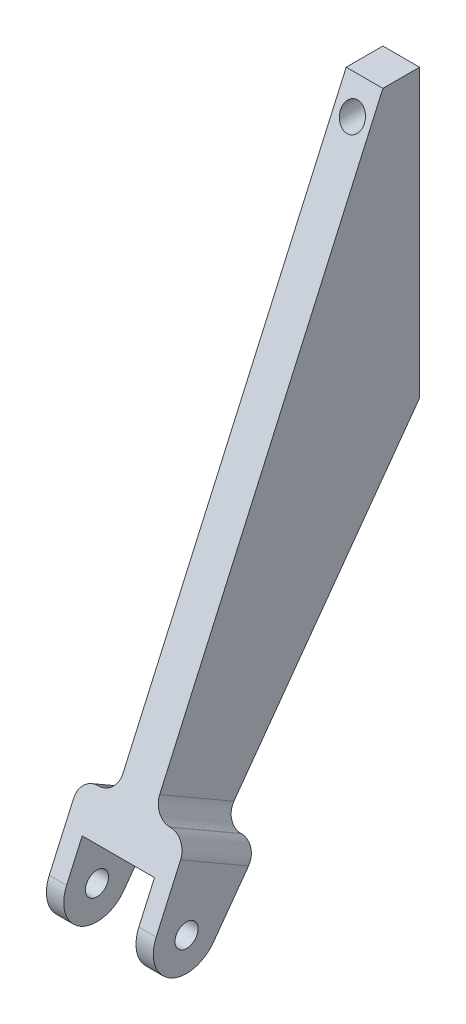
ISO-10303-21;
HEADER;
FILE_DESCRIPTION(('STEP AP214'),'2;1');
FILE_NAME('part.step','',(''),(''),'','','');
FILE_SCHEMA(('AUTOMOTIVE_DESIGN { 1 0 10303 214 1 1 1 1 }'));
ENDSEC;
DATA;
#1=APPLICATION_CONTEXT('core data for automotive mechanical design processes');
#2=APPLICATION_PROTOCOL_DEFINITION('international standard','automotive_design',2000,#1);
#3=PRODUCT_CONTEXT('',#1,'mechanical');
#4=PRODUCT('Part','Part','',(#3));
#5=PRODUCT_RELATED_PRODUCT_CATEGORY('part','',(#4));
#6=PRODUCT_DEFINITION_FORMATION('','',#4);
#7=PRODUCT_DEFINITION_CONTEXT('part definition',#1,'design');
#8=PRODUCT_DEFINITION('design','',#6,#7);
#9=PRODUCT_DEFINITION_SHAPE('','',#8);
#10=(LENGTH_UNIT() NAMED_UNIT(*) SI_UNIT(.MILLI.,.METRE.));
#11=(NAMED_UNIT(*) PLANE_ANGLE_UNIT() SI_UNIT($,.RADIAN.));
#12=(NAMED_UNIT(*) SI_UNIT($,.STERADIAN.) SOLID_ANGLE_UNIT());
#13=UNCERTAINTY_MEASURE_WITH_UNIT(LENGTH_MEASURE(1.E-05),#10,'distance_accuracy_value','');
#14=(GEOMETRIC_REPRESENTATION_CONTEXT(3) GLOBAL_UNCERTAINTY_ASSIGNED_CONTEXT((#13)) GLOBAL_UNIT_ASSIGNED_CONTEXT((#10,
#11,#12)) REPRESENTATION_CONTEXT('',''));
#15=CARTESIAN_POINT('',(0.,0.,0.));
#16=DIRECTION('',(0.,0.,1.));
#17=DIRECTION('',(1.,0.,0.));
#18=AXIS2_PLACEMENT_3D('',#15,#16,#17);
#19=CARTESIAN_POINT('',(-78.4084452466419,-210.483790761918,92.7733037843869));
#20=DIRECTION('',(1.,0.,0.));
#21=DIRECTION('',(0.,0.,-1.));
#22=AXIS2_PLACEMENT_3D('',#19,#20,#21);
#23=CYLINDRICAL_SURFACE('',#22,11.5);
#24=DIRECTION('',(1.,0.,0.));
#25=VECTOR('',#24,1.);
#26=CARTESIAN_POINT('',(-78.4084452466419,-205.796191727349,103.274561580056));
#27=LINE('',#26,#25);
#28=CARTESIAN_POINT('',(-59.558445246642,-205.796191727349,103.274561580056));
#29=VERTEX_POINT('',#28);
#30=CARTESIAN_POINT('',(-53.558445246642,-205.796191727349,103.274561580056));
#31=VERTEX_POINT('',#30);
#32=EDGE_CURVE('E257',#29,#31,#27,.T.);
#33=ORIENTED_EDGE('',*,*,#32,.F.);
#34=CARTESIAN_POINT('',(-59.558445246642,-210.483790761918,92.7733037843869));
#35=DIRECTION('',(-1.,0.,0.));
#36=DIRECTION('',(0.,0.,1.));
#37=AXIS2_PLACEMENT_3D('',#34,#35,#36);
#38=CIRCLE('',#37,11.5);
#39=CARTESIAN_POINT('',(-59.558445246642,-217.229583095587,83.4596425391511));
#40=VERTEX_POINT('',#39);
#41=EDGE_CURVE('E202',#29,#40,#38,.F.);
#42=ORIENTED_EDGE('',*,*,#41,.T.);
#43=DIRECTION('',(1.,0.,0.));
#44=VECTOR('',#43,1.);
#45=CARTESIAN_POINT('',(-78.4084452466419,-217.229583095587,83.4596425391511));
#46=LINE('',#45,#44);
#47=CARTESIAN_POINT('',(-53.558445246642,-217.229583095587,83.4596425391511));
#48=VERTEX_POINT('',#47);
#49=EDGE_CURVE('E200',#40,#48,#46,.T.);
#50=ORIENTED_EDGE('',*,*,#49,.T.);
#51=CARTESIAN_POINT('',(-53.558445246642,-210.483790761918,92.7733037843869));
#52=DIRECTION('',(1.,0.,0.));
#53=DIRECTION('',(0.,0.,-1.));
#54=AXIS2_PLACEMENT_3D('',#51,#52,#53);
#55=CIRCLE('',#54,11.5);
#56=EDGE_CURVE('E225',#31,#48,#55,.T.);
#57=ORIENTED_EDGE('',*,*,#56,.F.);
#58=EDGE_LOOP('',(#33,#42,#50,#57));
#59=FACE_BOUND('',#58,.T.);
#60=ADVANCED_FACE('F58',(#59),#23,.T.);
#61=CARTESIAN_POINT('',(-78.4084452466419,-210.483790761918,92.7733037843869));
#62=DIRECTION('',(1.,0.,0.));
#63=DIRECTION('',(0.,0.,-1.));
#64=AXIS2_PLACEMENT_3D('',#61,#62,#63);
#65=CYLINDRICAL_SURFACE('',#64,4.00000000000001);
#66=CARTESIAN_POINT('',(-53.558445246642,-210.483790761918,92.7733037843869));
#67=DIRECTION('',(1.,0.,0.));
#68=DIRECTION('',(0.,0.,-1.));
#69=AXIS2_PLACEMENT_3D('',#66,#67,#68);
#70=CIRCLE('',#69,4.00000000000001);
#71=CARTESIAN_POINT('',(-53.558445246642,-210.483790761918,88.7733037843869));
#72=VERTEX_POINT('',#71);
#73=EDGE_CURVE('E214',#72,#72,#70,.T.);
#74=ORIENTED_EDGE('',*,*,#73,.T.);
#75=EDGE_LOOP('',(#74));
#76=FACE_BOUND('',#75,.T.);
#77=CARTESIAN_POINT('',(-59.558445246642,-210.483790761918,92.7733037843869));
#78=DIRECTION('',(-1.,0.,0.));
#79=DIRECTION('',(0.,0.,1.));
#80=AXIS2_PLACEMENT_3D('',#77,#78,#79);
#81=CIRCLE('',#80,4.00000000000001);
#82=CARTESIAN_POINT('',(-59.558445246642,-210.483790761918,96.773303784387));
#83=VERTEX_POINT('',#82);
#84=EDGE_CURVE('E289',#83,#83,#81,.F.);
#85=ORIENTED_EDGE('',*,*,#84,.F.);
#86=EDGE_LOOP('',(#85));
#87=FACE_BOUND('',#86,.T.);
#88=ADVANCED_FACE('F350',(#76,#87),#65,.F.);
#89=CARTESIAN_POINT('',(-65.7084452466419,-322.212396424115,112.776));
#90=DIRECTION('',(-1.,0.,0.));
#91=DIRECTION('',(0.,0.,1.));
#92=AXIS2_PLACEMENT_3D('',#89,#90,#91);
#93=PLANE('',#92);
#94=DIRECTION('',(0.,-0.913152851797348,0.407617307353811));
#95=VECTOR('',#94,1.);
#96=CARTESIAN_POINT('',(-65.7084452466419,4.24711590624918,9.51447824157033));
#97=LINE('',#96,#95);
#98=CARTESIAN_POINT('',(-65.7084452466419,-2.88915683215951,12.7));
#99=VERTEX_POINT('',#98);
#100=CARTESIAN_POINT('',(-65.7084452466419,-175.878153334414,89.9196120477492));
#101=VERTEX_POINT('',#100);
#102=EDGE_CURVE('E258',#99,#101,#97,.T.);
#103=ORIENTED_EDGE('',*,*,#102,.T.);
#104=DIRECTION('',(0.,0.499778445707467,0.866153280433798));
#105=VECTOR('',#104,1.);
#106=CARTESIAN_POINT('',(-65.7084452466419,-190.383527582941,64.78071780933));
#107=LINE('',#106,#105);
#108=CARTESIAN_POINT('',(-65.7084452466419,-190.695002178179,64.2409091305958));
#109=VERTEX_POINT('',#108);
#110=EDGE_CURVE('E318',#101,#109,#107,.F.);
#111=ORIENTED_EDGE('',*,*,#110,.T.);
#112=DIRECTION('',(0.,-0.809883586542247,0.586590637710377));
#113=VECTOR('',#112,1.);
#114=CARTESIAN_POINT('',(-65.7084452466419,-35.0970347774457,-48.4571532091004));
#115=LINE('',#114,#113);
#116=CARTESIAN_POINT('',(-65.7084452466419,-102.,0.));
#117=VERTEX_POINT('',#116);
#118=EDGE_CURVE('E254',#117,#109,#115,.T.);
#119=ORIENTED_EDGE('',*,*,#118,.F.);
#120=DIRECTION('',(0.,1.,0.));
#121=VECTOR('',#120,1.);
#122=CARTESIAN_POINT('',(-65.7084452466419,-322.212396424115,0.));
#123=LINE('',#122,#121);
#124=CARTESIAN_POINT('',(-65.7084452466419,-2.88915683215951,0.));
#125=VERTEX_POINT('',#124);
#126=EDGE_CURVE('E265',#117,#125,#123,.T.);
#127=ORIENTED_EDGE('',*,*,#126,.T.);
#128=DIRECTION('',(0.,0.,-1.));
#129=VECTOR('',#128,1.);
#130=CARTESIAN_POINT('',(-65.7084452466419,-2.88915683215951,112.776));
#131=LINE('',#130,#129);
#132=EDGE_CURVE('E284',#99,#125,#131,.T.);
#133=ORIENTED_EDGE('',*,*,#132,.F.);
#134=EDGE_LOOP('',(#103,#111,#119,#127,#133));
#135=FACE_BOUND('',#134,.T.);
#136=ADVANCED_FACE('F333',(#135),#93,.F.);
#137=CARTESIAN_POINT('',(-78.4084452466419,-322.212396424115,112.776));
#138=DIRECTION('',(1.,0.,0.));
#139=DIRECTION('',(0.,0.,-1.));
#140=AXIS2_PLACEMENT_3D('',#137,#138,#139);
#141=PLANE('',#140);
#142=DIRECTION('',(0.,-0.809883586542247,0.586590637710377));
#143=VECTOR('',#142,1.);
#144=CARTESIAN_POINT('',(-78.4084452466419,-35.0970347774457,-48.4571532091004));
#145=LINE('',#144,#143);
#146=CARTESIAN_POINT('',(-78.4084452466419,-102.,0.));
#147=VERTEX_POINT('',#146);
#148=CARTESIAN_POINT('',(-78.4084452466419,-190.695002178179,64.2409091305958));
#149=VERTEX_POINT('',#148);
#150=EDGE_CURVE('E253',#147,#149,#145,.T.);
#151=ORIENTED_EDGE('',*,*,#150,.T.);
#152=DIRECTION('',(0.,-0.499778445707467,-0.866153280433798));
#153=VECTOR('',#152,1.);
#154=CARTESIAN_POINT('',(-78.4084452466419,-176.189627929652,89.3798033690149));
#155=LINE('',#154,#153);
#156=CARTESIAN_POINT('',(-78.4084452466419,-175.878153334414,89.9196120477492));
#157=VERTEX_POINT('',#156);
#158=EDGE_CURVE('E308',#149,#157,#155,.F.);
#159=ORIENTED_EDGE('',*,*,#158,.T.);
#160=DIRECTION('',(0.,-0.913152851797348,0.407617307353811));
#161=VECTOR('',#160,1.);
#162=CARTESIAN_POINT('',(-78.4084452466419,4.24711590624918,9.51447824157033));
#163=LINE('',#162,#161);
#164=CARTESIAN_POINT('',(-78.4084452466419,-2.88915683215951,12.7));
#165=VERTEX_POINT('',#164);
#166=EDGE_CURVE('E250',#165,#157,#163,.T.);
#167=ORIENTED_EDGE('',*,*,#166,.F.);
#168=DIRECTION('',(0.,0.,-1.));
#169=VECTOR('',#168,1.);
#170=CARTESIAN_POINT('',(-78.4084452466419,-2.88915683215951,112.776));
#171=LINE('',#170,#169);
#172=CARTESIAN_POINT('',(-78.4084452466419,-2.88915683215951,0.));
#173=VERTEX_POINT('',#172);
#174=EDGE_CURVE('E282',#165,#173,#171,.T.);
#175=ORIENTED_EDGE('',*,*,#174,.T.);
#176=DIRECTION('',(0.,-1.,0.));
#177=VECTOR('',#176,1.);
#178=CARTESIAN_POINT('',(-78.4084452466419,-322.212396424115,0.));
#179=LINE('',#178,#177);
#180=EDGE_CURVE('E279',#173,#147,#179,.T.);
#181=ORIENTED_EDGE('',*,*,#180,.T.);
#182=EDGE_LOOP('',(#151,#159,#167,#175,#181));
#183=FACE_BOUND('',#182,.T.);
#184=ADVANCED_FACE('F398',(#183),#141,.F.);
#185=CARTESIAN_POINT('',(-78.4084452466419,-2.88915683215951,112.776));
#186=DIRECTION('',(0.,-1.,0.));
#187=DIRECTION('',(0.,0.,-1.));
#188=AXIS2_PLACEMENT_3D('',#185,#186,#187);
#189=PLANE('',#188);
#190=DIRECTION('',(1.,0.,0.));
#191=VECTOR('',#190,1.);
#192=CARTESIAN_POINT('',(-78.4084452466419,-2.88915683215951,12.7));
#193=LINE('',#192,#191);
#194=EDGE_CURVE('E268',#165,#99,#193,.T.);
#195=ORIENTED_EDGE('',*,*,#194,.T.);
#196=ORIENTED_EDGE('',*,*,#132,.T.);
#197=DIRECTION('',(-1.,0.,0.));
#198=VECTOR('',#197,1.);
#199=CARTESIAN_POINT('',(-78.4084452466419,-2.88915683215951,0.));
#200=LINE('',#199,#198);
#201=EDGE_CURVE('E276',#125,#173,#200,.T.);
#202=ORIENTED_EDGE('',*,*,#201,.T.);
#203=ORIENTED_EDGE('',*,*,#174,.F.);
#204=EDGE_LOOP('',(#195,#196,#202,#203));
#205=FACE_BOUND('',#204,.T.);
#206=ADVANCED_FACE('F369',(#205),#189,.F.);
#207=CARTESIAN_POINT('',(0.,0.,0.));
#208=DIRECTION('',(0.,0.,-1.));
#209=DIRECTION('',(-1.,0.,0.));
#210=AXIS2_PLACEMENT_3D('',#207,#208,#209);
#211=PLANE('',#210);
#212=CARTESIAN_POINT('',(-72.,-12.4141568321594,0.));
#213=DIRECTION('',(0.,0.,-1.));
#214=DIRECTION('',(-1.,0.,0.));
#215=AXIS2_PLACEMENT_3D('',#212,#213,#214);
#216=CIRCLE('',#215,4.12750000000001);
#217=CARTESIAN_POINT('',(-76.1275,-12.4141568321594,0.));
#218=VERTEX_POINT('',#217);
#219=EDGE_CURVE('E241',#218,#218,#216,.T.);
#220=ORIENTED_EDGE('',*,*,#219,.F.);
#221=EDGE_LOOP('',(#220));
#222=FACE_BOUND('',#221,.T.);
#223=CARTESIAN_POINT('',(-72.,-91.7891568321594,0.));
#224=DIRECTION('',(0.,0.,-1.));
#225=DIRECTION('',(-1.,0.,0.));
#226=AXIS2_PLACEMENT_3D('',#223,#224,#225);
#227=CIRCLE('',#226,4.12750000000001);
#228=CARTESIAN_POINT('',(-76.1275,-91.7891568321594,0.));
#229=VERTEX_POINT('',#228);
#230=EDGE_CURVE('E240',#229,#229,#227,.T.);
#231=ORIENTED_EDGE('',*,*,#230,.F.);
#232=EDGE_LOOP('',(#231));
#233=FACE_BOUND('',#232,.T.);
#234=DIRECTION('',(1.,0.,0.));
#235=VECTOR('',#234,1.);
#236=CARTESIAN_POINT('',(-78.4084452466419,-102.,0.));
#237=LINE('',#236,#235);
#238=EDGE_CURVE('E266',#147,#117,#237,.T.);
#239=ORIENTED_EDGE('',*,*,#238,.F.);
#240=ORIENTED_EDGE('',*,*,#180,.F.);
#241=ORIENTED_EDGE('',*,*,#201,.F.);
#242=ORIENTED_EDGE('',*,*,#126,.F.);
#243=EDGE_LOOP('',(#239,#240,#241,#242));
#244=FACE_BOUND('',#243,.T.);
#245=ADVANCED_FACE('F362',(#222,#233,#244),#211,.T.);
#246=CARTESIAN_POINT('',(-84.558445246642,-210.483790761918,92.7733037843869));
#247=DIRECTION('',(-1.,0.,0.));
#248=DIRECTION('',(0.,0.,1.));
#249=AXIS2_PLACEMENT_3D('',#246,#247,#248);
#250=CIRCLE('',#249,11.5);
#251=CARTESIAN_POINT('',(-84.558445246642,-205.796191727349,103.274561580056));
#252=VERTEX_POINT('',#251);
#253=CARTESIAN_POINT('',(-84.558445246642,-217.229583095587,83.4596425391511));
#254=VERTEX_POINT('',#253);
#255=EDGE_CURVE('E211',#252,#254,#250,.F.);
#256=ORIENTED_EDGE('',*,*,#255,.F.);
#257=CARTESIAN_POINT('',(-90.558445246642,-205.796191727349,103.274561580056));
#258=VERTEX_POINT('',#257);
#259=EDGE_CURVE('E271',#258,#252,#27,.T.);
#260=ORIENTED_EDGE('',*,*,#259,.F.);
#261=CARTESIAN_POINT('',(-90.558445246642,-210.483790761918,92.7733037843869));
#262=DIRECTION('',(1.,0.,0.));
#263=DIRECTION('',(0.,0.,-1.));
#264=AXIS2_PLACEMENT_3D('',#261,#262,#263);
#265=CIRCLE('',#264,11.5);
#266=CARTESIAN_POINT('',(-90.558445246642,-217.229583095587,83.4596425391511));
#267=VERTEX_POINT('',#266);
#268=EDGE_CURVE('E223',#258,#267,#265,.T.);
#269=ORIENTED_EDGE('',*,*,#268,.T.);
#270=EDGE_CURVE('E262',#267,#254,#46,.T.);
#271=ORIENTED_EDGE('',*,*,#270,.T.);
#272=EDGE_LOOP('',(#256,#260,#269,#271));
#273=FACE_BOUND('',#272,.T.);
#274=ADVANCED_FACE('F352',(#273),#23,.T.);
#275=CARTESIAN_POINT('',(-78.4084452466419,-35.0970347774457,-48.4571532091004));
#276=DIRECTION('',(0.,0.586590637710377,0.809883586542247));
#277=DIRECTION('',(0.,-0.809883586542247,0.586590637710377));
#278=AXIS2_PLACEMENT_3D('',#275,#276,#277);
#279=PLANE('',#278);
#280=DIRECTION('',(0.,0.809883586542247,-0.586590637710377));
#281=VECTOR('',#280,1.);
#282=CARTESIAN_POINT('',(-90.558445246642,-217.229583095587,83.4596425391511));
#283=LINE('',#282,#281);
#284=CARTESIAN_POINT('',(-90.558445246642,-200.465892352909,71.3178678365538));
#285=VERTEX_POINT('',#284);
#286=EDGE_CURVE('E217',#267,#285,#283,.T.);
#287=ORIENTED_EDGE('',*,*,#286,.T.);
#288=CARTESIAN_POINT('',(-84.558445246642,-200.465892352909,71.3178678365538));
#289=DIRECTION('',(0.,0.586590637710377,0.809883586542247));
#290=DIRECTION('',(0.,-0.809883586542247,0.586590637710377));
#291=AXIS2_PLACEMENT_3D('',#288,#289,#290);
#292=ELLIPSE('',#291,6.03228064939915,6.);
#293=CARTESIAN_POINT('',(-84.558445246642,-195.580447265544,67.7793884835748));
#294=VERTEX_POINT('',#293);
#295=EDGE_CURVE('E306',#285,#294,#292,.F.);
#296=ORIENTED_EDGE('',*,*,#295,.T.);
#297=DIRECTION('',(-1.,0.,0.));
#298=VECTOR('',#297,1.);
#299=CARTESIAN_POINT('',(-53.558445246642,-195.580447265544,67.7793884835748));
#300=LINE('',#299,#298);
#301=CARTESIAN_POINT('',(-84.408445246642,-195.580447265544,67.7793884835748));
#302=VERTEX_POINT('',#301);
#303=EDGE_CURVE('E237',#302,#294,#300,.T.);
#304=ORIENTED_EDGE('',*,*,#303,.F.);
#305=CARTESIAN_POINT('',(-84.408445246642,-190.695002178179,64.2409091305958));
#306=DIRECTION('',(0.,0.586590637710377,0.809883586542247));
#307=DIRECTION('',(0.,-0.809883586542247,0.586590637710377));
#308=AXIS2_PLACEMENT_3D('',#305,#306,#307);
#309=ELLIPSE('',#308,6.03228064939915,6.);
#310=EDGE_CURVE('E320',#302,#149,#309,.T.);
#311=ORIENTED_EDGE('',*,*,#310,.T.);
#312=ORIENTED_EDGE('',*,*,#150,.F.);
#313=ORIENTED_EDGE('',*,*,#238,.T.);
#314=ORIENTED_EDGE('',*,*,#118,.T.);
#315=CARTESIAN_POINT('',(-59.708445246642,-190.695002178179,64.2409091305958));
#316=DIRECTION('',(0.,0.586590637710377,0.809883586542247));
#317=DIRECTION('',(0.,0.809883586542247,-0.586590637710377));
#318=AXIS2_PLACEMENT_3D('',#315,#316,#317);
#319=ELLIPSE('',#318,6.03228064939915,6.);
#320=CARTESIAN_POINT('',(-59.708445246642,-195.580447265544,67.7793884835748));
#321=VERTEX_POINT('',#320);
#322=EDGE_CURVE('E12',#109,#321,#319,.T.);
#323=ORIENTED_EDGE('',*,*,#322,.T.);
#324=CARTESIAN_POINT('',(-59.558445246642,-195.580447265544,67.7793884835748));
#325=VERTEX_POINT('',#324);
#326=EDGE_CURVE('E238',#325,#321,#300,.T.);
#327=ORIENTED_EDGE('',*,*,#326,.F.);
#328=CARTESIAN_POINT('',(-59.558445246642,-200.465892352909,71.3178678365538));
#329=DIRECTION('',(0.,0.586590637710377,0.809883586542247));
#330=DIRECTION('',(0.,0.809883586542247,-0.586590637710377));
#331=AXIS2_PLACEMENT_3D('',#328,#329,#330);
#332=ELLIPSE('',#331,6.03228064939915,6.);
#333=CARTESIAN_POINT('',(-53.558445246642,-200.465892352909,71.3178678365538));
#334=VERTEX_POINT('',#333);
#335=EDGE_CURVE('E73',#325,#334,#332,.F.);
#336=ORIENTED_EDGE('',*,*,#335,.T.);
#337=DIRECTION('',(0.,0.809883586542247,-0.586590637710377));
#338=VECTOR('',#337,1.);
#339=CARTESIAN_POINT('',(-53.558445246642,-217.229583095587,83.4596425391511));
#340=LINE('',#339,#338);
#341=EDGE_CURVE('E220',#48,#334,#340,.T.);
#342=ORIENTED_EDGE('',*,*,#341,.F.);
#343=ORIENTED_EDGE('',*,*,#49,.F.);
#344=DIRECTION('',(0.,-0.809883586542247,0.586590637710377));
#345=VECTOR('',#344,1.);
#346=CARTESIAN_POINT('',(-59.558445246642,-35.0970347774457,-48.4571532091004));
#347=LINE('',#346,#345);
#348=CARTESIAN_POINT('',(-59.558445246642,-206.491274627326,75.6819923718946));
#349=VERTEX_POINT('',#348);
#350=EDGE_CURVE('E192',#349,#40,#347,.T.);
#351=ORIENTED_EDGE('',*,*,#350,.F.);
#352=DIRECTION('',(-1.,0.,0.));
#353=VECTOR('',#352,1.);
#354=CARTESIAN_POINT('',(-78.4084452466419,-206.491274627326,75.6819923718947));
#355=LINE('',#354,#353);
#356=CARTESIAN_POINT('',(-84.558445246642,-206.491274627326,75.6819923718946));
#357=VERTEX_POINT('',#356);
#358=EDGE_CURVE('E178',#349,#357,#355,.T.);
#359=ORIENTED_EDGE('',*,*,#358,.T.);
#360=DIRECTION('',(0.,-0.809883586542247,0.586590637710377));
#361=VECTOR('',#360,1.);
#362=CARTESIAN_POINT('',(-84.558445246642,-35.0970347774457,-48.4571532091004));
#363=LINE('',#362,#361);
#364=EDGE_CURVE('E188',#357,#254,#363,.T.);
#365=ORIENTED_EDGE('',*,*,#364,.T.);
#366=ORIENTED_EDGE('',*,*,#270,.F.);
#367=EDGE_LOOP('',(#287,#296,#304,#311,#312,#313,#314,#323,#327,#336,#342,#343,#351,#359,#365,#366));
#368=FACE_BOUND('',#367,.T.);
#369=ADVANCED_FACE('F199',(#368),#279,.F.);
#370=CARTESIAN_POINT('',(-78.4084452466419,4.24711590624918,9.51447824157033));
#371=DIRECTION('',(0.,0.407617307353811,0.913152851797348));
#372=DIRECTION('',(0.,-0.913152851797348,0.407617307353811));
#373=AXIS2_PLACEMENT_3D('',#370,#371,#372);
#374=PLANE('',#373);
#375=DIRECTION('',(-1.,0.,0.));
#376=VECTOR('',#375,1.);
#377=CARTESIAN_POINT('',(-53.558445246642,-181.386547612255,92.3784740432597));
#378=LINE('',#377,#376);
#379=CARTESIAN_POINT('',(-84.408445246642,-181.386547612255,92.3784740432597));
#380=VERTEX_POINT('',#379);
#381=CARTESIAN_POINT('',(-84.558445246642,-181.386547612255,92.3784740432597));
#382=VERTEX_POINT('',#381);
#383=EDGE_CURVE('E228',#380,#382,#378,.T.);
#384=ORIENTED_EDGE('',*,*,#383,.T.);
#385=CARTESIAN_POINT('',(-84.558445246642,-186.894941890096,94.8373360387703));
#386=DIRECTION('',(0.,0.407617307353811,0.913152851797348));
#387=DIRECTION('',(0.,0.913152851797348,-0.407617307353811));
#388=AXIS2_PLACEMENT_3D('',#385,#386,#387);
#389=ELLIPSE('',#388,6.03228064939915,6.);
#390=CARTESIAN_POINT('',(-90.558445246642,-186.894941890096,94.8373360387703));
#391=VERTEX_POINT('',#390);
#392=EDGE_CURVE('E301',#382,#391,#389,.T.);
#393=ORIENTED_EDGE('',*,*,#392,.T.);
#394=DIRECTION('',(0.,-0.913152851797348,0.407617307353811));
#395=VECTOR('',#394,1.);
#396=CARTESIAN_POINT('',(-90.558445246642,-205.796191727349,103.274561580056));
#397=LINE('',#396,#395);
#398=EDGE_CURVE('E230',#391,#258,#397,.T.);
#399=ORIENTED_EDGE('',*,*,#398,.T.);
#400=ORIENTED_EDGE('',*,*,#259,.T.);
#401=DIRECTION('',(0.,-0.913152851797348,0.407617307353811));
#402=VECTOR('',#401,1.);
#403=CARTESIAN_POINT('',(-84.558445246642,4.24711590624918,9.51447824157033));
#404=LINE('',#403,#402);
#405=CARTESIAN_POINT('',(-84.558445246642,-193.6886281661,97.8699324999));
#406=VERTEX_POINT('',#405);
#407=EDGE_CURVE('E205',#406,#252,#404,.T.);
#408=ORIENTED_EDGE('',*,*,#407,.F.);
#409=DIRECTION('',(-1.,0.,0.));
#410=VECTOR('',#409,1.);
#411=CARTESIAN_POINT('',(-78.4084452466419,-193.6886281661,97.8699324999));
#412=LINE('',#411,#410);
#413=CARTESIAN_POINT('',(-59.558445246642,-193.6886281661,97.8699324999));
#414=VERTEX_POINT('',#413);
#415=EDGE_CURVE('E286',#414,#406,#412,.T.);
#416=ORIENTED_EDGE('',*,*,#415,.F.);
#417=DIRECTION('',(0.,-0.913152851797348,0.407617307353811));
#418=VECTOR('',#417,1.);
#419=CARTESIAN_POINT('',(-59.558445246642,4.24711590624918,9.51447824157033));
#420=LINE('',#419,#418);
#421=EDGE_CURVE('E195',#414,#29,#420,.T.);
#422=ORIENTED_EDGE('',*,*,#421,.T.);
#423=ORIENTED_EDGE('',*,*,#32,.T.);
#424=DIRECTION('',(0.,-0.913152851797348,0.407617307353811));
#425=VECTOR('',#424,1.);
#426=CARTESIAN_POINT('',(-53.558445246642,-205.796191727349,103.274561580056));
#427=LINE('',#426,#425);
#428=CARTESIAN_POINT('',(-53.558445246642,-186.894941890096,94.8373360387703));
#429=VERTEX_POINT('',#428);
#430=EDGE_CURVE('E222',#429,#31,#427,.T.);
#431=ORIENTED_EDGE('',*,*,#430,.F.);
#432=CARTESIAN_POINT('',(-59.558445246642,-186.894941890096,94.8373360387703));
#433=DIRECTION('',(0.,0.407617307353811,0.913152851797348));
#434=DIRECTION('',(0.,-0.913152851797348,0.407617307353811));
#435=AXIS2_PLACEMENT_3D('',#432,#433,#434);
#436=ELLIPSE('',#435,6.03228064939915,6.);
#437=CARTESIAN_POINT('',(-59.558445246642,-181.386547612255,92.3784740432597));
#438=VERTEX_POINT('',#437);
#439=EDGE_CURVE('E299',#429,#438,#436,.T.);
#440=ORIENTED_EDGE('',*,*,#439,.T.);
#441=CARTESIAN_POINT('',(-59.708445246642,-181.386547612255,92.3784740432597));
#442=VERTEX_POINT('',#441);
#443=EDGE_CURVE('E234',#438,#442,#378,.T.);
#444=ORIENTED_EDGE('',*,*,#443,.T.);
#445=CARTESIAN_POINT('',(-59.708445246642,-175.878153334414,89.9196120477491));
#446=DIRECTION('',(0.,0.407617307353811,0.913152851797348));
#447=DIRECTION('',(0.,-0.913152851797348,0.407617307353811));
#448=AXIS2_PLACEMENT_3D('',#445,#446,#447);
#449=ELLIPSE('',#448,6.03228064939915,6.);
#450=EDGE_CURVE('E66',#442,#101,#449,.F.);
#451=ORIENTED_EDGE('',*,*,#450,.T.);
#452=ORIENTED_EDGE('',*,*,#102,.F.);
#453=ORIENTED_EDGE('',*,*,#194,.F.);
#454=ORIENTED_EDGE('',*,*,#166,.T.);
#455=CARTESIAN_POINT('',(-84.408445246642,-175.878153334414,89.9196120477491));
#456=DIRECTION('',(0.,0.407617307353811,0.913152851797348));
#457=DIRECTION('',(0.,0.913152851797348,-0.407617307353811));
#458=AXIS2_PLACEMENT_3D('',#455,#456,#457);
#459=ELLIPSE('',#458,6.03228064939915,6.);
#460=EDGE_CURVE('E322',#157,#380,#459,.F.);
#461=ORIENTED_EDGE('',*,*,#460,.T.);
#462=EDGE_LOOP('',(#384,#393,#399,#400,#408,#416,#422,#423,#431,#440,#444,#451,#452,#453,#454,#461));
#463=FACE_BOUND('',#462,.T.);
#464=CARTESIAN_POINT('',(-72.,-12.4141568321594,16.9518126564496));
#465=DIRECTION('',(0.,0.407617307353811,0.913152851797348));
#466=DIRECTION('',(0.,0.913152851797348,-0.407617307353811));
#467=AXIS2_PLACEMENT_3D('',#464,#465,#466);
#468=ELLIPSE('',#467,4.52005378056467,4.12750000000001);
#469=CARTESIAN_POINT('',(-72.,-8.28665683215941,15.1093605053214));
#470=VERTEX_POINT('',#469);
#471=EDGE_CURVE('E244',#470,#470,#468,.T.);
#472=ORIENTED_EDGE('',*,*,#471,.F.);
#473=EDGE_LOOP('',(#472));
#474=FACE_BOUND('',#473,.T.);
#475=ADVANCED_FACE('F325',(#463,#474),#374,.T.);
#476=CARTESIAN_POINT('',(-72.,-12.4141568321594,25.4));
#477=DIRECTION('',(0.,0.,-1.));
#478=DIRECTION('',(-1.,0.,0.));
#479=AXIS2_PLACEMENT_3D('',#476,#477,#478);
#480=CYLINDRICAL_SURFACE('',#479,4.12750000000001);
#481=ORIENTED_EDGE('',*,*,#471,.T.);
#482=EDGE_LOOP('',(#481));
#483=FACE_BOUND('',#482,.T.);
#484=ORIENTED_EDGE('',*,*,#219,.T.);
#485=EDGE_LOOP('',(#484));
#486=FACE_BOUND('',#485,.T.);
#487=ADVANCED_FACE('F488',(#483,#486),#480,.F.);
#488=CARTESIAN_POINT('',(-72.,-91.7891568321594,25.4));
#489=DIRECTION('',(0.,0.,-1.));
#490=DIRECTION('',(-1.,0.,0.));
#491=AXIS2_PLACEMENT_3D('',#488,#489,#490);
#492=CYLINDRICAL_SURFACE('',#491,4.12750000000001);
#493=CARTESIAN_POINT('',(-72.,-91.7891568321594,25.4));
#494=DIRECTION('',(0.,0.,-1.));
#495=DIRECTION('',(-1.,0.,0.));
#496=AXIS2_PLACEMENT_3D('',#493,#494,#495);
#497=CIRCLE('',#496,4.12750000000001);
#498=CARTESIAN_POINT('',(-76.1275,-91.7891568321594,25.4));
#499=VERTEX_POINT('',#498);
#500=EDGE_CURVE('E245',#499,#499,#497,.T.);
#501=ORIENTED_EDGE('',*,*,#500,.F.);
#502=EDGE_LOOP('',(#501));
#503=FACE_BOUND('',#502,.T.);
#504=ORIENTED_EDGE('',*,*,#230,.T.);
#505=EDGE_LOOP('',(#504));
#506=FACE_BOUND('',#505,.T.);
#507=ADVANCED_FACE('F563',(#503,#506),#492,.F.);
#508=CARTESIAN_POINT('',(-72.,-91.7891568321594,25.4));
#509=DIRECTION('',(0.,0.,-1.));
#510=DIRECTION('',(-1.,0.,0.));
#511=AXIS2_PLACEMENT_3D('',#508,#509,#510);
#512=PLANE('',#511);
#513=ORIENTED_EDGE('',*,*,#500,.T.);
#514=EDGE_LOOP('',(#513));
#515=FACE_BOUND('',#514,.T.);
#516=ADVANCED_FACE('F479',(#515),#512,.T.);
#517=CARTESIAN_POINT('',(-53.558445246642,-195.580447265544,67.7793884835748));
#518=DIRECTION('',(0.,-0.866153280433798,0.499778445707467));
#519=DIRECTION('',(0.,-0.499778445707467,-0.866153280433798));
#520=AXIS2_PLACEMENT_3D('',#517,#518,#519);
#521=PLANE('',#520);
#522=ORIENTED_EDGE('',*,*,#303,.T.);
#523=DIRECTION('',(0.,0.499778445707467,0.866153280433798));
#524=VECTOR('',#523,1.);
#525=CARTESIAN_POINT('',(-84.558445246642,-195.580447265544,67.7793884835748));
#526=LINE('',#525,#524);
#527=EDGE_CURVE('E296',#294,#382,#526,.T.);
#528=ORIENTED_EDGE('',*,*,#527,.T.);
#529=ORIENTED_EDGE('',*,*,#383,.F.);
#530=DIRECTION('',(0.,-0.499778445707467,-0.866153280433798));
#531=VECTOR('',#530,1.);
#532=CARTESIAN_POINT('',(-84.408445246642,-195.580447265544,67.7793884835748));
#533=LINE('',#532,#531);
#534=EDGE_CURVE('E293',#380,#302,#533,.T.);
#535=ORIENTED_EDGE('',*,*,#534,.T.);
#536=EDGE_LOOP('',(#522,#528,#529,#535));
#537=FACE_BOUND('',#536,.T.);
#538=ADVANCED_FACE('F389',(#537),#521,.F.);
#539=CARTESIAN_POINT('',(-90.558445246642,-210.483790761918,92.7733037843869));
#540=DIRECTION('',(1.,0.,0.));
#541=DIRECTION('',(0.,0.,-1.));
#542=AXIS2_PLACEMENT_3D('',#539,#540,#541);
#543=PLANE('',#542);
#544=ORIENTED_EDGE('',*,*,#398,.F.);
#545=DIRECTION('',(0.,0.499778445707467,0.866153280433798));
#546=VECTOR('',#545,1.);
#547=CARTESIAN_POINT('',(-90.558445246642,-193.680417121502,83.0776019376621));
#548=LINE('',#547,#546);
#549=EDGE_CURVE('E303',#391,#285,#548,.F.);
#550=ORIENTED_EDGE('',*,*,#549,.T.);
#551=ORIENTED_EDGE('',*,*,#286,.F.);
#552=ORIENTED_EDGE('',*,*,#268,.F.);
#553=EDGE_LOOP('',(#544,#550,#551,#552));
#554=FACE_BOUND('',#553,.T.);
#555=CARTESIAN_POINT('',(-90.558445246642,-210.483790761918,92.7733037843869));
#556=DIRECTION('',(1.,0.,0.));
#557=DIRECTION('',(0.,0.,-1.));
#558=AXIS2_PLACEMENT_3D('',#555,#556,#557);
#559=CIRCLE('',#558,4.00000000000001);
#560=CARTESIAN_POINT('',(-90.558445246642,-210.483790761918,88.7733037843869));
#561=VERTEX_POINT('',#560);
#562=EDGE_CURVE('E187',#561,#561,#559,.T.);
#563=ORIENTED_EDGE('',*,*,#562,.T.);
#564=EDGE_LOOP('',(#563));
#565=FACE_BOUND('',#564,.T.);
#566=ADVANCED_FACE('F379',(#554,#565),#543,.F.);
#567=CARTESIAN_POINT('',(-84.558445246642,-210.483790761918,92.7733037843869));
#568=DIRECTION('',(-1.,0.,0.));
#569=DIRECTION('',(0.,0.,1.));
#570=AXIS2_PLACEMENT_3D('',#567,#568,#569);
#571=CIRCLE('',#570,4.00000000000001);
#572=CARTESIAN_POINT('',(-84.558445246642,-210.483790761918,96.773303784387));
#573=VERTEX_POINT('',#572);
#574=EDGE_CURVE('E201',#573,#573,#571,.F.);
#575=ORIENTED_EDGE('',*,*,#574,.T.);
#576=EDGE_LOOP('',(#575));
#577=FACE_BOUND('',#576,.T.);
#578=ORIENTED_EDGE('',*,*,#562,.F.);
#579=EDGE_LOOP('',(#578));
#580=FACE_BOUND('',#579,.T.);
#581=ADVANCED_FACE('F358',(#577,#580),#65,.F.);
#582=ORIENTED_EDGE('',*,*,#443,.F.);
#583=DIRECTION('',(0.,0.499778445707467,0.866153280433798));
#584=VECTOR('',#583,1.);
#585=CARTESIAN_POINT('',(-59.558445246642,-195.580447265544,67.7793884835748));
#586=LINE('',#585,#584);
#587=EDGE_CURVE('E316',#438,#325,#586,.F.);
#588=ORIENTED_EDGE('',*,*,#587,.T.);
#589=ORIENTED_EDGE('',*,*,#326,.T.);
#590=DIRECTION('',(0.,0.499778445707467,0.866153280433798));
#591=VECTOR('',#590,1.);
#592=CARTESIAN_POINT('',(-59.708445246642,-181.386547612255,92.3784740432597));
#593=LINE('',#592,#591);
#594=EDGE_CURVE('E313',#321,#442,#593,.T.);
#595=ORIENTED_EDGE('',*,*,#594,.T.);
#596=EDGE_LOOP('',(#582,#588,#589,#595));
#597=FACE_BOUND('',#596,.T.);
#598=ADVANCED_FACE('F336',(#597),#521,.F.);
#599=CARTESIAN_POINT('',(-53.558445246642,-210.483790761918,92.7733037843869));
#600=DIRECTION('',(1.,0.,0.));
#601=DIRECTION('',(0.,0.,-1.));
#602=AXIS2_PLACEMENT_3D('',#599,#600,#601);
#603=PLANE('',#602);
#604=ORIENTED_EDGE('',*,*,#341,.T.);
#605=DIRECTION('',(0.,0.499778445707467,0.866153280433798));
#606=VECTOR('',#605,1.);
#607=CARTESIAN_POINT('',(-53.558445246642,-186.583467294858,95.3771447175045));
#608=LINE('',#607,#606);
#609=EDGE_CURVE('E310',#334,#429,#608,.T.);
#610=ORIENTED_EDGE('',*,*,#609,.T.);
#611=ORIENTED_EDGE('',*,*,#430,.T.);
#612=ORIENTED_EDGE('',*,*,#56,.T.);
#613=EDGE_LOOP('',(#604,#610,#611,#612));
#614=FACE_BOUND('',#613,.T.);
#615=ORIENTED_EDGE('',*,*,#73,.F.);
#616=EDGE_LOOP('',(#615));
#617=FACE_BOUND('',#616,.T.);
#618=ADVANCED_FACE('F343',(#614,#617),#603,.T.);
#619=CARTESIAN_POINT('',(-84.558445246642,-190.796243790936,102.882650107754));
#620=DIRECTION('',(0.,0.866153280433798,-0.499778445707467));
#621=DIRECTION('',(0.,0.499778445707467,0.866153280433798));
#622=AXIS2_PLACEMENT_3D('',#619,#620,#621);
#623=PLANE('',#622);
#624=DIRECTION('',(0.,0.499778445707466,0.866153280433798));
#625=VECTOR('',#624,1.);
#626=CARTESIAN_POINT('',(-59.558445246642,-190.796243790936,102.882650107754));
#627=LINE('',#626,#625);
#628=EDGE_CURVE('E181',#349,#414,#627,.T.);
#629=ORIENTED_EDGE('',*,*,#628,.T.);
#630=ORIENTED_EDGE('',*,*,#415,.T.);
#631=DIRECTION('',(0.,0.499778445707466,0.866153280433798));
#632=VECTOR('',#631,1.);
#633=CARTESIAN_POINT('',(-84.558445246642,-190.796243790936,102.882650107754));
#634=LINE('',#633,#632);
#635=EDGE_CURVE('E184',#357,#406,#634,.T.);
#636=ORIENTED_EDGE('',*,*,#635,.F.);
#637=ORIENTED_EDGE('',*,*,#358,.F.);
#638=EDGE_LOOP('',(#629,#630,#636,#637));
#639=FACE_BOUND('',#638,.T.);
#640=ADVANCED_FACE('F180',(#639),#623,.F.);
#641=CARTESIAN_POINT('',(-84.558445246642,0.,0.));
#642=DIRECTION('',(-1.,0.,0.));
#643=DIRECTION('',(0.,0.,1.));
#644=AXIS2_PLACEMENT_3D('',#641,#642,#643);
#645=PLANE('',#644);
#646=ORIENTED_EDGE('',*,*,#574,.F.);
#647=EDGE_LOOP('',(#646));
#648=FACE_BOUND('',#647,.T.);
#649=ORIENTED_EDGE('',*,*,#635,.T.);
#650=ORIENTED_EDGE('',*,*,#407,.T.);
#651=ORIENTED_EDGE('',*,*,#255,.T.);
#652=ORIENTED_EDGE('',*,*,#364,.F.);
#653=EDGE_LOOP('',(#649,#650,#651,#652));
#654=FACE_BOUND('',#653,.T.);
#655=ADVANCED_FACE('F517',(#648,#654),#645,.F.);
#656=CARTESIAN_POINT('',(-59.558445246642,0.,0.));
#657=DIRECTION('',(-1.,0.,0.));
#658=DIRECTION('',(0.,0.,1.));
#659=AXIS2_PLACEMENT_3D('',#656,#657,#658);
#660=PLANE('',#659);
#661=ORIENTED_EDGE('',*,*,#84,.T.);
#662=EDGE_LOOP('',(#661));
#663=FACE_BOUND('',#662,.T.);
#664=ORIENTED_EDGE('',*,*,#350,.T.);
#665=ORIENTED_EDGE('',*,*,#41,.F.);
#666=ORIENTED_EDGE('',*,*,#421,.F.);
#667=ORIENTED_EDGE('',*,*,#628,.F.);
#668=EDGE_LOOP('',(#664,#665,#666,#667));
#669=FACE_BOUND('',#668,.T.);
#670=ADVANCED_FACE('F191',(#663,#669),#660,.T.);
#671=CARTESIAN_POINT('',(-84.558445246642,-200.777366948147,70.7780591578196));
#672=DIRECTION('',(0.,0.499778445707467,0.866153280433798));
#673=DIRECTION('',(0.,-0.866153280433798,0.499778445707467));
#674=AXIS2_PLACEMENT_3D('',#671,#672,#673);
#675=CYLINDRICAL_SURFACE('',#674,6.);
#676=ORIENTED_EDGE('',*,*,#295,.F.);
#677=ORIENTED_EDGE('',*,*,#549,.F.);
#678=ORIENTED_EDGE('',*,*,#392,.F.);
#679=ORIENTED_EDGE('',*,*,#527,.F.);
#680=EDGE_LOOP('',(#676,#677,#678,#679));
#681=FACE_BOUND('',#680,.T.);
#682=ADVANCED_FACE('F384',(#681),#675,.T.);
#683=CARTESIAN_POINT('',(-84.408445246642,-190.383527582941,64.78071780933));
#684=DIRECTION('',(0.,0.499778445707467,0.866153280433798));
#685=DIRECTION('',(0.,-0.866153280433798,0.499778445707467));
#686=AXIS2_PLACEMENT_3D('',#683,#684,#685);
#687=CYLINDRICAL_SURFACE('',#686,6.);
#688=ORIENTED_EDGE('',*,*,#460,.F.);
#689=ORIENTED_EDGE('',*,*,#158,.F.);
#690=ORIENTED_EDGE('',*,*,#310,.F.);
#691=ORIENTED_EDGE('',*,*,#534,.F.);
#692=EDGE_LOOP('',(#688,#689,#690,#691));
#693=FACE_BOUND('',#692,.T.);
#694=ADVANCED_FACE('F394',(#693),#687,.F.);
#695=CARTESIAN_POINT('',(-59.558445246642,-193.680417121502,83.0776019376621));
#696=DIRECTION('',(0.,-0.499778445707467,-0.866153280433798));
#697=DIRECTION('',(0.,0.866153280433798,-0.499778445707467));
#698=AXIS2_PLACEMENT_3D('',#695,#696,#697);
#699=CYLINDRICAL_SURFACE('',#698,6.);
#700=ORIENTED_EDGE('',*,*,#335,.F.);
#701=ORIENTED_EDGE('',*,*,#587,.F.);
#702=ORIENTED_EDGE('',*,*,#439,.F.);
#703=ORIENTED_EDGE('',*,*,#609,.F.);
#704=EDGE_LOOP('',(#700,#701,#702,#703));
#705=FACE_BOUND('',#704,.T.);
#706=ADVANCED_FACE('F340',(#705),#699,.T.);
#707=CARTESIAN_POINT('',(-59.708445246642,-190.383527582941,64.78071780933));
#708=DIRECTION('',(0.,-0.499778445707467,-0.866153280433798));
#709=DIRECTION('',(0.,0.866153280433798,-0.499778445707467));
#710=AXIS2_PLACEMENT_3D('',#707,#708,#709);
#711=CYLINDRICAL_SURFACE('',#710,6.);
#712=ORIENTED_EDGE('',*,*,#322,.F.);
#713=ORIENTED_EDGE('',*,*,#110,.F.);
#714=ORIENTED_EDGE('',*,*,#450,.F.);
#715=ORIENTED_EDGE('',*,*,#594,.F.);
#716=EDGE_LOOP('',(#712,#713,#714,#715));
#717=FACE_BOUND('',#716,.T.);
#718=ADVANCED_FACE('F60',(#717),#711,.F.);
#719=CLOSED_SHELL('',(#60,#88,#136,#184,#206,#245,#274,#369,#475,#487,#507,#516,#538,#566,#581,
#598,#618,#640,#655,#670,#682,#694,#706,#718));
#720=MANIFOLD_SOLID_BREP('B2',#719);
#721=ADVANCED_BREP_SHAPE_REPRESENTATION('',(#18,#720),#14);
#722=SHAPE_DEFINITION_REPRESENTATION(#9,#721);
ENDSEC;
END-ISO-10303-21;
